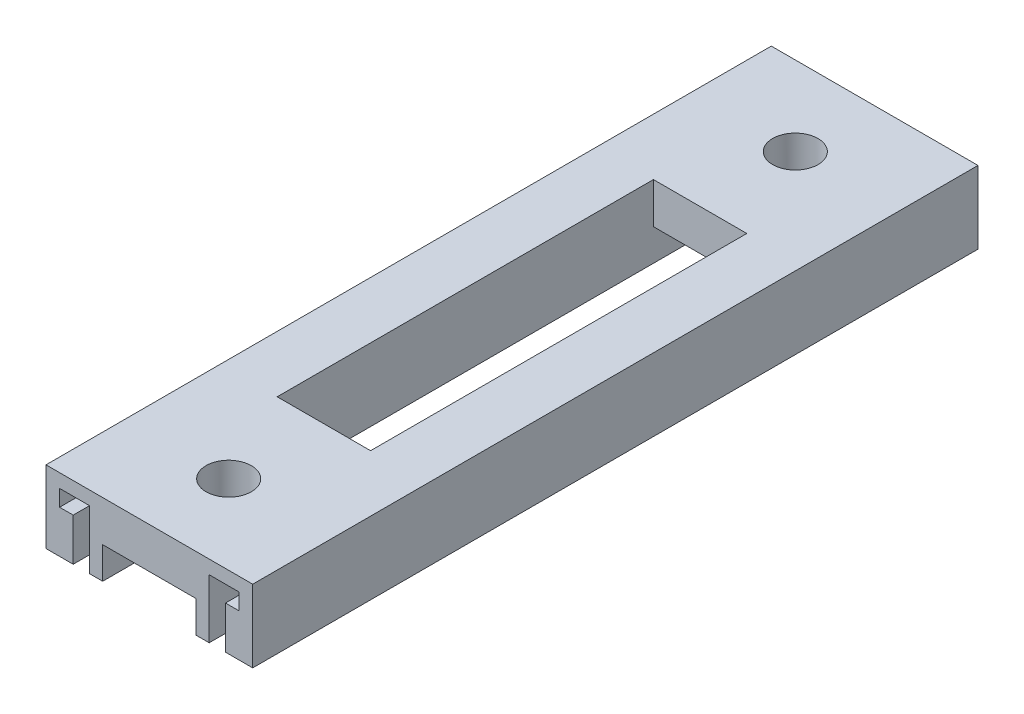
ISO-10303-21;
HEADER;
FILE_DESCRIPTION(('STEP AP214'),'2;1');
FILE_NAME('part.step','',(''),(''),'','','');
FILE_SCHEMA(('AUTOMOTIVE_DESIGN { 1 0 10303 214 1 1 1 1 }'));
ENDSEC;
DATA;
#1=APPLICATION_CONTEXT('core data for automotive mechanical design processes');
#2=APPLICATION_PROTOCOL_DEFINITION('international standard','automotive_design',2000,#1);
#3=PRODUCT_CONTEXT('',#1,'mechanical');
#4=PRODUCT('Part','Part','',(#3));
#5=PRODUCT_RELATED_PRODUCT_CATEGORY('part','',(#4));
#6=PRODUCT_DEFINITION_FORMATION('','',#4);
#7=PRODUCT_DEFINITION_CONTEXT('part definition',#1,'design');
#8=PRODUCT_DEFINITION('design','',#6,#7);
#9=PRODUCT_DEFINITION_SHAPE('','',#8);
#10=(LENGTH_UNIT() NAMED_UNIT(*) SI_UNIT(.MILLI.,.METRE.));
#11=(NAMED_UNIT(*) PLANE_ANGLE_UNIT() SI_UNIT($,.RADIAN.));
#12=(NAMED_UNIT(*) SI_UNIT($,.STERADIAN.) SOLID_ANGLE_UNIT());
#13=UNCERTAINTY_MEASURE_WITH_UNIT(LENGTH_MEASURE(1.E-05),#10,'distance_accuracy_value','');
#14=(GEOMETRIC_REPRESENTATION_CONTEXT(3) GLOBAL_UNCERTAINTY_ASSIGNED_CONTEXT((#13)) GLOBAL_UNIT_ASSIGNED_CONTEXT((#10,
#11,#12)) REPRESENTATION_CONTEXT('',''));
#15=CARTESIAN_POINT('',(0.,0.,0.));
#16=DIRECTION('',(0.,0.,1.));
#17=DIRECTION('',(1.,0.,0.));
#18=AXIS2_PLACEMENT_3D('',#15,#16,#17);
#19=CARTESIAN_POINT('',(0.,7.,0.));
#20=DIRECTION('',(0.,1.,0.));
#21=DIRECTION('',(0.,0.,1.));
#22=AXIS2_PLACEMENT_3D('',#19,#20,#21);
#23=PLANE('',#22);
#24=CARTESIAN_POINT('',(16.8,7.,17.5));
#25=DIRECTION('',(0.,1.,0.));
#26=DIRECTION('',(0.,0.,1.));
#27=AXIS2_PLACEMENT_3D('',#24,#25,#26);
#28=CIRCLE('',#27,5.);
#29=CARTESIAN_POINT('',(16.8,7.,22.5));
#30=VERTEX_POINT('',#29);
#31=EDGE_CURVE('E244',#30,#30,#28,.T.);
#32=ORIENTED_EDGE('',*,*,#31,.T.);
#33=EDGE_LOOP('',(#32));
#34=FACE_BOUND('',#33,.T.);
#35=DIRECTION('',(0.,0.,-1.));
#36=VECTOR('',#35,1.);
#37=CARTESIAN_POINT('',(27.1,7.,160.));
#38=LINE('',#37,#36);
#39=CARTESIAN_POINT('',(27.1,7.,38.5));
#40=VERTEX_POINT('',#39);
#41=CARTESIAN_POINT('',(27.1,7.,0.));
#42=VERTEX_POINT('',#41);
#43=EDGE_CURVE('E356',#40,#42,#38,.T.);
#44=ORIENTED_EDGE('',*,*,#43,.F.);
#45=DIRECTION('',(1.,0.,0.));
#46=VECTOR('',#45,1.);
#47=CARTESIAN_POINT('',(6.5,7.00000000000001,38.5));
#48=LINE('',#47,#46);
#49=CARTESIAN_POINT('',(6.49999999999999,7.00000000000001,38.5));
#50=VERTEX_POINT('',#49);
#51=EDGE_CURVE('E231',#50,#40,#48,.T.);
#52=ORIENTED_EDGE('',*,*,#51,.F.);
#53=DIRECTION('',(0.,0.,1.));
#54=VECTOR('',#53,1.);
#55=CARTESIAN_POINT('',(6.5,7.,160.));
#56=LINE('',#55,#54);
#57=CARTESIAN_POINT('',(6.5,7.,0.));
#58=VERTEX_POINT('',#57);
#59=EDGE_CURVE('E348',#58,#50,#56,.T.);
#60=ORIENTED_EDGE('',*,*,#59,.F.);
#61=DIRECTION('',(-1.,0.,0.));
#62=VECTOR('',#61,1.);
#63=CARTESIAN_POINT('',(6.5,7.,0.));
#64=LINE('',#63,#62);
#65=EDGE_CURVE('E359',#42,#58,#64,.T.);
#66=ORIENTED_EDGE('',*,*,#65,.F.);
#67=EDGE_LOOP('',(#44,#52,#60,#66));
#68=FACE_BOUND('',#67,.T.);
#69=ADVANCED_FACE('F38',(#34,#68),#23,.F.);
#70=CARTESIAN_POINT('',(-6.,0.,160.));
#71=DIRECTION('',(0.,1.,0.));
#72=DIRECTION('',(0.,0.,1.));
#73=AXIS2_PLACEMENT_3D('',#70,#71,#72);
#74=PLANE('',#73);
#75=DIRECTION('',(1.,0.,0.));
#76=VECTOR('',#75,1.);
#77=CARTESIAN_POINT('',(-6.,0.,0.));
#78=LINE('',#77,#76);
#79=CARTESIAN_POINT('',(-6.,0.,0.));
#80=VERTEX_POINT('',#79);
#81=CARTESIAN_POINT('',(0.,0.,0.));
#82=VERTEX_POINT('',#81);
#83=EDGE_CURVE('E363',#80,#82,#78,.T.);
#84=ORIENTED_EDGE('',*,*,#83,.T.);
#85=DIRECTION('',(0.,0.,-1.));
#86=VECTOR('',#85,1.);
#87=CARTESIAN_POINT('',(0.,0.,160.));
#88=LINE('',#87,#86);
#89=CARTESIAN_POINT('',(0.,0.,160.));
#90=VERTEX_POINT('',#89);
#91=EDGE_CURVE('E11',#90,#82,#88,.T.);
#92=ORIENTED_EDGE('',*,*,#91,.F.);
#93=DIRECTION('',(1.,0.,0.));
#94=VECTOR('',#93,1.);
#95=CARTESIAN_POINT('',(-6.,0.,160.));
#96=LINE('',#95,#94);
#97=CARTESIAN_POINT('',(-6.,0.,160.));
#98=VERTEX_POINT('',#97);
#99=EDGE_CURVE('E364',#98,#90,#96,.T.);
#100=ORIENTED_EDGE('',*,*,#99,.F.);
#101=DIRECTION('',(0.,0.,-1.));
#102=VECTOR('',#101,1.);
#103=CARTESIAN_POINT('',(-6.,0.,160.));
#104=LINE('',#103,#102);
#105=EDGE_CURVE('E397',#98,#80,#104,.T.);
#106=ORIENTED_EDGE('',*,*,#105,.T.);
#107=EDGE_LOOP('',(#84,#92,#100,#106));
#108=FACE_BOUND('',#107,.T.);
#109=ADVANCED_FACE('F40',(#108),#74,.F.);
#110=CARTESIAN_POINT('',(0.,0.,160.));
#111=DIRECTION('',(-1.,0.,0.));
#112=DIRECTION('',(0.,0.,1.));
#113=AXIS2_PLACEMENT_3D('',#110,#111,#112);
#114=PLANE('',#113);
#115=DIRECTION('',(0.,1.,0.));
#116=VECTOR('',#115,1.);
#117=CARTESIAN_POINT('',(0.,0.,0.));
#118=LINE('',#117,#116);
#119=CARTESIAN_POINT('',(0.,9.4,0.));
#120=VERTEX_POINT('',#119);
#121=EDGE_CURVE('E401',#82,#120,#118,.T.);
#122=ORIENTED_EDGE('',*,*,#121,.T.);
#123=DIRECTION('',(0.,0.,-1.));
#124=VECTOR('',#123,1.);
#125=CARTESIAN_POINT('',(0.,9.4,160.));
#126=LINE('',#125,#124);
#127=CARTESIAN_POINT('',(0.,9.4,160.));
#128=VERTEX_POINT('',#127);
#129=EDGE_CURVE('E47',#128,#120,#126,.T.);
#130=ORIENTED_EDGE('',*,*,#129,.F.);
#131=DIRECTION('',(0.,1.,0.));
#132=VECTOR('',#131,1.);
#133=CARTESIAN_POINT('',(0.,0.,160.));
#134=LINE('',#133,#132);
#135=EDGE_CURVE('E368',#90,#128,#134,.T.);
#136=ORIENTED_EDGE('',*,*,#135,.F.);
#137=ORIENTED_EDGE('',*,*,#91,.T.);
#138=EDGE_LOOP('',(#122,#130,#136,#137));
#139=FACE_BOUND('',#138,.T.);
#140=ADVANCED_FACE('F483',(#139),#114,.F.);
#141=CARTESIAN_POINT('',(0.,9.4,160.));
#142=DIRECTION('',(0.,-1.,0.));
#143=DIRECTION('',(0.,0.,-1.));
#144=AXIS2_PLACEMENT_3D('',#141,#142,#143);
#145=PLANE('',#144);
#146=DIRECTION('',(-1.,0.,0.));
#147=VECTOR('',#146,1.);
#148=CARTESIAN_POINT('',(0.,9.4,0.));
#149=LINE('',#148,#147);
#150=CARTESIAN_POINT('',(-3.,9.4,0.));
#151=VERTEX_POINT('',#150);
#152=EDGE_CURVE('E404',#120,#151,#149,.T.);
#153=ORIENTED_EDGE('',*,*,#152,.T.);
#154=DIRECTION('',(0.,0.,-1.));
#155=VECTOR('',#154,1.);
#156=CARTESIAN_POINT('',(-3.,9.4,160.));
#157=LINE('',#156,#155);
#158=CARTESIAN_POINT('',(-3.,9.4,160.));
#159=VERTEX_POINT('',#158);
#160=EDGE_CURVE('E451',#159,#151,#157,.T.);
#161=ORIENTED_EDGE('',*,*,#160,.F.);
#162=DIRECTION('',(-1.,0.,0.));
#163=VECTOR('',#162,1.);
#164=CARTESIAN_POINT('',(0.,9.4,160.));
#165=LINE('',#164,#163);
#166=EDGE_CURVE('E372',#128,#159,#165,.T.);
#167=ORIENTED_EDGE('',*,*,#166,.F.);
#168=ORIENTED_EDGE('',*,*,#129,.T.);
#169=EDGE_LOOP('',(#153,#161,#167,#168));
#170=FACE_BOUND('',#169,.T.);
#171=ADVANCED_FACE('F460',(#170),#145,.F.);
#172=CARTESIAN_POINT('',(-3.,9.4,160.));
#173=DIRECTION('',(-1.,0.,0.));
#174=DIRECTION('',(0.,0.,1.));
#175=AXIS2_PLACEMENT_3D('',#172,#173,#174);
#176=PLANE('',#175);
#177=DIRECTION('',(0.,1.,0.));
#178=VECTOR('',#177,1.);
#179=CARTESIAN_POINT('',(-3.,9.4,0.));
#180=LINE('',#179,#178);
#181=CARTESIAN_POINT('',(-3.,13.,0.));
#182=VERTEX_POINT('',#181);
#183=EDGE_CURVE('E407',#151,#182,#180,.T.);
#184=ORIENTED_EDGE('',*,*,#183,.T.);
#185=DIRECTION('',(0.,0.,-1.));
#186=VECTOR('',#185,1.);
#187=CARTESIAN_POINT('',(-3.,13.,160.));
#188=LINE('',#187,#186);
#189=CARTESIAN_POINT('',(-3.,13.,160.));
#190=VERTEX_POINT('',#189);
#191=EDGE_CURVE('E447',#190,#182,#188,.T.);
#192=ORIENTED_EDGE('',*,*,#191,.F.);
#193=DIRECTION('',(0.,1.,0.));
#194=VECTOR('',#193,1.);
#195=CARTESIAN_POINT('',(-3.,9.4,160.));
#196=LINE('',#195,#194);
#197=EDGE_CURVE('E375',#159,#190,#196,.T.);
#198=ORIENTED_EDGE('',*,*,#197,.F.);
#199=ORIENTED_EDGE('',*,*,#160,.T.);
#200=EDGE_LOOP('',(#184,#192,#198,#199));
#201=FACE_BOUND('',#200,.T.);
#202=ADVANCED_FACE('F471',(#201),#176,.F.);
#203=CARTESIAN_POINT('',(-3.,13.,160.));
#204=DIRECTION('',(0.,1.,0.));
#205=DIRECTION('',(0.,0.,1.));
#206=AXIS2_PLACEMENT_3D('',#203,#204,#205);
#207=PLANE('',#206);
#208=DIRECTION('',(1.,0.,0.));
#209=VECTOR('',#208,1.);
#210=CARTESIAN_POINT('',(-3.,13.,0.));
#211=LINE('',#210,#209);
#212=CARTESIAN_POINT('',(3.6,13.,0.));
#213=VERTEX_POINT('',#212);
#214=EDGE_CURVE('E410',#182,#213,#211,.T.);
#215=ORIENTED_EDGE('',*,*,#214,.T.);
#216=DIRECTION('',(0.,0.,-1.));
#217=VECTOR('',#216,1.);
#218=CARTESIAN_POINT('',(3.6,13.,160.));
#219=LINE('',#218,#217);
#220=CARTESIAN_POINT('',(3.6,13.,160.));
#221=VERTEX_POINT('',#220);
#222=EDGE_CURVE('E443',#221,#213,#219,.T.);
#223=ORIENTED_EDGE('',*,*,#222,.F.);
#224=DIRECTION('',(1.,0.,0.));
#225=VECTOR('',#224,1.);
#226=CARTESIAN_POINT('',(-3.,13.,160.));
#227=LINE('',#226,#225);
#228=EDGE_CURVE('E378',#190,#221,#227,.T.);
#229=ORIENTED_EDGE('',*,*,#228,.F.);
#230=ORIENTED_EDGE('',*,*,#191,.T.);
#231=EDGE_LOOP('',(#215,#223,#229,#230));
#232=FACE_BOUND('',#231,.T.);
#233=ADVANCED_FACE('F475',(#232),#207,.F.);
#234=CARTESIAN_POINT('',(3.6,13.,160.));
#235=DIRECTION('',(1.,0.,0.));
#236=DIRECTION('',(0.,0.,-1.));
#237=AXIS2_PLACEMENT_3D('',#234,#235,#236);
#238=PLANE('',#237);
#239=DIRECTION('',(0.,-1.,0.));
#240=VECTOR('',#239,1.);
#241=CARTESIAN_POINT('',(3.6,13.,0.));
#242=LINE('',#241,#240);
#243=CARTESIAN_POINT('',(3.6,0.,0.));
#244=VERTEX_POINT('',#243);
#245=EDGE_CURVE('E413',#213,#244,#242,.T.);
#246=ORIENTED_EDGE('',*,*,#245,.T.);
#247=DIRECTION('',(0.,0.,-1.));
#248=VECTOR('',#247,1.);
#249=CARTESIAN_POINT('',(3.6,0.,160.));
#250=LINE('',#249,#248);
#251=CARTESIAN_POINT('',(3.6,0.,160.));
#252=VERTEX_POINT('',#251);
#253=EDGE_CURVE('E439',#252,#244,#250,.T.);
#254=ORIENTED_EDGE('',*,*,#253,.F.);
#255=DIRECTION('',(0.,-1.,0.));
#256=VECTOR('',#255,1.);
#257=CARTESIAN_POINT('',(3.6,13.,160.));
#258=LINE('',#257,#256);
#259=EDGE_CURVE('E381',#221,#252,#258,.T.);
#260=ORIENTED_EDGE('',*,*,#259,.F.);
#261=ORIENTED_EDGE('',*,*,#222,.T.);
#262=EDGE_LOOP('',(#246,#254,#260,#261));
#263=FACE_BOUND('',#262,.T.);
#264=ADVANCED_FACE('F548',(#263),#238,.F.);
#265=CARTESIAN_POINT('',(3.6,0.,160.));
#266=DIRECTION('',(0.,1.,0.));
#267=DIRECTION('',(0.,0.,1.));
#268=AXIS2_PLACEMENT_3D('',#265,#266,#267);
#269=PLANE('',#268);
#270=DIRECTION('',(1.,0.,0.));
#271=VECTOR('',#270,1.);
#272=CARTESIAN_POINT('',(3.6,0.,0.));
#273=LINE('',#272,#271);
#274=CARTESIAN_POINT('',(6.5,0.,0.));
#275=VERTEX_POINT('',#274);
#276=EDGE_CURVE('E416',#244,#275,#273,.T.);
#277=ORIENTED_EDGE('',*,*,#276,.T.);
#278=DIRECTION('',(0.,0.,-1.));
#279=VECTOR('',#278,1.);
#280=CARTESIAN_POINT('',(6.5,0.,160.));
#281=LINE('',#280,#279);
#282=CARTESIAN_POINT('',(6.5,0.,160.));
#283=VERTEX_POINT('',#282);
#284=EDGE_CURVE('E435',#283,#275,#281,.T.);
#285=ORIENTED_EDGE('',*,*,#284,.F.);
#286=DIRECTION('',(1.,0.,0.));
#287=VECTOR('',#286,1.);
#288=CARTESIAN_POINT('',(3.6,0.,160.));
#289=LINE('',#288,#287);
#290=EDGE_CURVE('E384',#252,#283,#289,.T.);
#291=ORIENTED_EDGE('',*,*,#290,.F.);
#292=ORIENTED_EDGE('',*,*,#253,.T.);
#293=EDGE_LOOP('',(#277,#285,#291,#292));
#294=FACE_BOUND('',#293,.T.);
#295=ADVANCED_FACE('F546',(#294),#269,.F.);
#296=CARTESIAN_POINT('',(6.5,0.,160.));
#297=DIRECTION('',(-1.,0.,0.));
#298=DIRECTION('',(0.,0.,1.));
#299=AXIS2_PLACEMENT_3D('',#296,#297,#298);
#300=PLANE('',#299);
#301=DIRECTION('',(0.,1.,0.));
#302=VECTOR('',#301,1.);
#303=CARTESIAN_POINT('',(6.5,0.,0.));
#304=LINE('',#303,#302);
#305=EDGE_CURVE('E419',#275,#58,#304,.T.);
#306=ORIENTED_EDGE('',*,*,#305,.T.);
#307=ORIENTED_EDGE('',*,*,#59,.T.);
#308=DIRECTION('',(0.,1.,0.));
#309=VECTOR('',#308,1.);
#310=CARTESIAN_POINT('',(6.49999999999999,-78.5181852005759,38.5));
#311=LINE('',#310,#309);
#312=CARTESIAN_POINT('',(6.49999999999999,16.,38.5));
#313=VERTEX_POINT('',#312);
#314=EDGE_CURVE('E228',#50,#313,#311,.T.);
#315=ORIENTED_EDGE('',*,*,#314,.T.);
#316=DIRECTION('',(0.,0.,1.));
#317=VECTOR('',#316,1.);
#318=CARTESIAN_POINT('',(6.5,16.,160.));
#319=LINE('',#318,#317);
#320=CARTESIAN_POINT('',(6.5,16.,121.5));
#321=VERTEX_POINT('',#320);
#322=EDGE_CURVE('E54',#313,#321,#319,.T.);
#323=ORIENTED_EDGE('',*,*,#322,.T.);
#324=DIRECTION('',(0.,1.,0.));
#325=VECTOR('',#324,1.);
#326=CARTESIAN_POINT('',(6.5,-78.5181852005759,121.5));
#327=LINE('',#326,#325);
#328=CARTESIAN_POINT('',(6.5,7.00000000000001,121.5));
#329=VERTEX_POINT('',#328);
#330=EDGE_CURVE('E210',#329,#321,#327,.T.);
#331=ORIENTED_EDGE('',*,*,#330,.F.);
#332=CARTESIAN_POINT('',(6.5,7.,160.));
#333=VERTEX_POINT('',#332);
#334=EDGE_CURVE('E347',#329,#333,#56,.T.);
#335=ORIENTED_EDGE('',*,*,#334,.T.);
#336=DIRECTION('',(0.,1.,0.));
#337=VECTOR('',#336,1.);
#338=CARTESIAN_POINT('',(6.5,0.,160.));
#339=LINE('',#338,#337);
#340=EDGE_CURVE('E387',#283,#333,#339,.T.);
#341=ORIENTED_EDGE('',*,*,#340,.F.);
#342=ORIENTED_EDGE('',*,*,#284,.T.);
#343=EDGE_LOOP('',(#306,#307,#315,#323,#331,#335,#341,#342));
#344=FACE_BOUND('',#343,.T.);
#345=ADVANCED_FACE('F541',(#344),#300,.F.);
#346=CARTESIAN_POINT('',(6.5,16.,160.));
#347=DIRECTION('',(0.,-1.,0.));
#348=DIRECTION('',(0.,0.,-1.));
#349=AXIS2_PLACEMENT_3D('',#346,#347,#348);
#350=PLANE('',#349);
#351=DIRECTION('',(1.,0.,0.));
#352=VECTOR('',#351,1.);
#353=CARTESIAN_POINT('',(6.5,16.,121.5));
#354=LINE('',#353,#352);
#355=CARTESIAN_POINT('',(27.1,16.,121.5));
#356=VERTEX_POINT('',#355);
#357=EDGE_CURVE('E213',#321,#356,#354,.T.);
#358=ORIENTED_EDGE('',*,*,#357,.F.);
#359=ORIENTED_EDGE('',*,*,#322,.F.);
#360=DIRECTION('',(-1.,0.,0.));
#361=VECTOR('',#360,1.);
#362=CARTESIAN_POINT('',(6.5,16.,38.5));
#363=LINE('',#362,#361);
#364=CARTESIAN_POINT('',(27.1,16.,38.5));
#365=VERTEX_POINT('',#364);
#366=EDGE_CURVE('E221',#365,#313,#363,.T.);
#367=ORIENTED_EDGE('',*,*,#366,.F.);
#368=DIRECTION('',(0.,0.,-1.));
#369=VECTOR('',#368,1.);
#370=CARTESIAN_POINT('',(27.1,16.,160.));
#371=LINE('',#370,#369);
#372=EDGE_CURVE('E204',#356,#365,#371,.T.);
#373=ORIENTED_EDGE('',*,*,#372,.F.);
#374=EDGE_LOOP('',(#358,#359,#367,#373));
#375=FACE_BOUND('',#374,.T.);
#376=CARTESIAN_POINT('',(16.8,16.,17.5));
#377=DIRECTION('',(0.,-1.,0.));
#378=DIRECTION('',(0.,0.,-1.));
#379=AXIS2_PLACEMENT_3D('',#376,#377,#378);
#380=CIRCLE('',#379,5.);
#381=CARTESIAN_POINT('',(16.8,16.,12.5));
#382=VERTEX_POINT('',#381);
#383=EDGE_CURVE('E240',#382,#382,#380,.T.);
#384=ORIENTED_EDGE('',*,*,#383,.T.);
#385=EDGE_LOOP('',(#384));
#386=FACE_BOUND('',#385,.T.);
#387=CARTESIAN_POINT('',(16.8,16.,142.5));
#388=DIRECTION('',(0.,-1.,0.));
#389=DIRECTION('',(0.,0.,-1.));
#390=AXIS2_PLACEMENT_3D('',#387,#388,#389);
#391=CIRCLE('',#390,5.);
#392=CARTESIAN_POINT('',(16.8,16.,137.5));
#393=VERTEX_POINT('',#392);
#394=EDGE_CURVE('E239',#393,#393,#391,.T.);
#395=ORIENTED_EDGE('',*,*,#394,.T.);
#396=EDGE_LOOP('',(#395));
#397=FACE_BOUND('',#396,.T.);
#398=DIRECTION('',(-1.,0.,0.));
#399=VECTOR('',#398,1.);
#400=CARTESIAN_POINT('',(6.5,16.,0.));
#401=LINE('',#400,#399);
#402=CARTESIAN_POINT('',(39.6,16.,0.));
#403=VERTEX_POINT('',#402);
#404=CARTESIAN_POINT('',(-6.,16.,0.));
#405=VERTEX_POINT('',#404);
#406=EDGE_CURVE('E423',#403,#405,#401,.T.);
#407=ORIENTED_EDGE('',*,*,#406,.T.);
#408=DIRECTION('',(0.,0.,-1.));
#409=VECTOR('',#408,1.);
#410=CARTESIAN_POINT('',(-6.,16.,160.));
#411=LINE('',#410,#409);
#412=CARTESIAN_POINT('',(-6.,16.,160.));
#413=VERTEX_POINT('',#412);
#414=EDGE_CURVE('E431',#413,#405,#411,.T.);
#415=ORIENTED_EDGE('',*,*,#414,.F.);
#416=DIRECTION('',(-1.,0.,0.));
#417=VECTOR('',#416,1.);
#418=CARTESIAN_POINT('',(6.5,16.,160.));
#419=LINE('',#418,#417);
#420=CARTESIAN_POINT('',(39.6,16.,160.));
#421=VERTEX_POINT('',#420);
#422=EDGE_CURVE('E391',#421,#413,#419,.T.);
#423=ORIENTED_EDGE('',*,*,#422,.F.);
#424=DIRECTION('',(0.,0.,-1.));
#425=VECTOR('',#424,1.);
#426=CARTESIAN_POINT('',(39.6,16.,160.));
#427=LINE('',#426,#425);
#428=EDGE_CURVE('E343',#421,#403,#427,.T.);
#429=ORIENTED_EDGE('',*,*,#428,.T.);
#430=EDGE_LOOP('',(#407,#415,#423,#429));
#431=FACE_BOUND('',#430,.T.);
#432=ADVANCED_FACE('F218',(#375,#386,#397,#431),#350,.F.);
#433=CARTESIAN_POINT('',(-6.,16.,160.));
#434=DIRECTION('',(1.,0.,0.));
#435=DIRECTION('',(0.,0.,-1.));
#436=AXIS2_PLACEMENT_3D('',#433,#434,#435);
#437=PLANE('',#436);
#438=DIRECTION('',(0.,-1.,0.));
#439=VECTOR('',#438,1.);
#440=CARTESIAN_POINT('',(-6.,16.,0.));
#441=LINE('',#440,#439);
#442=EDGE_CURVE('E369',#405,#80,#441,.T.);
#443=ORIENTED_EDGE('',*,*,#442,.T.);
#444=ORIENTED_EDGE('',*,*,#105,.F.);
#445=DIRECTION('',(0.,-1.,0.));
#446=VECTOR('',#445,1.);
#447=CARTESIAN_POINT('',(-6.,16.,160.));
#448=LINE('',#447,#446);
#449=EDGE_CURVE('E394',#413,#98,#448,.T.);
#450=ORIENTED_EDGE('',*,*,#449,.F.);
#451=ORIENTED_EDGE('',*,*,#414,.T.);
#452=EDGE_LOOP('',(#443,#444,#450,#451));
#453=FACE_BOUND('',#452,.T.);
#454=ADVANCED_FACE('F489',(#453),#437,.F.);
#455=CARTESIAN_POINT('',(0.,0.,160.));
#456=DIRECTION('',(0.,0.,1.));
#457=DIRECTION('',(1.,0.,0.));
#458=AXIS2_PLACEMENT_3D('',#455,#456,#457);
#459=PLANE('',#458);
#460=ORIENTED_EDGE('',*,*,#99,.T.);
#461=ORIENTED_EDGE('',*,*,#135,.T.);
#462=ORIENTED_EDGE('',*,*,#166,.T.);
#463=ORIENTED_EDGE('',*,*,#197,.T.);
#464=ORIENTED_EDGE('',*,*,#228,.T.);
#465=ORIENTED_EDGE('',*,*,#259,.T.);
#466=ORIENTED_EDGE('',*,*,#290,.T.);
#467=ORIENTED_EDGE('',*,*,#340,.T.);
#468=DIRECTION('',(1.,0.,0.));
#469=VECTOR('',#468,1.);
#470=CARTESIAN_POINT('',(6.5,7.,160.));
#471=LINE('',#470,#469);
#472=CARTESIAN_POINT('',(27.1,7.,160.));
#473=VERTEX_POINT('',#472);
#474=EDGE_CURVE('E352',#333,#473,#471,.T.);
#475=ORIENTED_EDGE('',*,*,#474,.T.);
#476=DIRECTION('',(0.,-1.,0.));
#477=VECTOR('',#476,1.);
#478=CARTESIAN_POINT('',(27.1,0.,160.));
#479=LINE('',#478,#477);
#480=CARTESIAN_POINT('',(27.1,0.,160.));
#481=VERTEX_POINT('',#480);
#482=EDGE_CURVE('E260',#473,#481,#479,.T.);
#483=ORIENTED_EDGE('',*,*,#482,.T.);
#484=DIRECTION('',(1.,0.,0.));
#485=VECTOR('',#484,1.);
#486=CARTESIAN_POINT('',(30.,0.,160.));
#487=LINE('',#486,#485);
#488=CARTESIAN_POINT('',(30.,0.,160.));
#489=VERTEX_POINT('',#488);
#490=EDGE_CURVE('E264',#481,#489,#487,.T.);
#491=ORIENTED_EDGE('',*,*,#490,.T.);
#492=DIRECTION('',(0.,1.,0.));
#493=VECTOR('',#492,1.);
#494=CARTESIAN_POINT('',(30.,13.,160.));
#495=LINE('',#494,#493);
#496=CARTESIAN_POINT('',(30.,13.,160.));
#497=VERTEX_POINT('',#496);
#498=EDGE_CURVE('E267',#489,#497,#495,.T.);
#499=ORIENTED_EDGE('',*,*,#498,.T.);
#500=DIRECTION('',(1.,0.,0.));
#501=VECTOR('',#500,1.);
#502=CARTESIAN_POINT('',(36.6,13.,160.));
#503=LINE('',#502,#501);
#504=CARTESIAN_POINT('',(36.6,13.,160.));
#505=VERTEX_POINT('',#504);
#506=EDGE_CURVE('E270',#497,#505,#503,.T.);
#507=ORIENTED_EDGE('',*,*,#506,.T.);
#508=DIRECTION('',(0.,-1.,0.));
#509=VECTOR('',#508,1.);
#510=CARTESIAN_POINT('',(36.6,9.4,160.));
#511=LINE('',#510,#509);
#512=CARTESIAN_POINT('',(36.6,9.4,160.));
#513=VERTEX_POINT('',#512);
#514=EDGE_CURVE('E273',#505,#513,#511,.T.);
#515=ORIENTED_EDGE('',*,*,#514,.T.);
#516=DIRECTION('',(-1.,0.,0.));
#517=VECTOR('',#516,1.);
#518=CARTESIAN_POINT('',(33.6,9.4,160.));
#519=LINE('',#518,#517);
#520=CARTESIAN_POINT('',(33.6,9.4,160.));
#521=VERTEX_POINT('',#520);
#522=EDGE_CURVE('E276',#513,#521,#519,.T.);
#523=ORIENTED_EDGE('',*,*,#522,.T.);
#524=DIRECTION('',(0.,-1.,0.));
#525=VECTOR('',#524,1.);
#526=CARTESIAN_POINT('',(33.6,0.,160.));
#527=LINE('',#526,#525);
#528=CARTESIAN_POINT('',(33.6,0.,160.));
#529=VERTEX_POINT('',#528);
#530=EDGE_CURVE('E279',#521,#529,#527,.T.);
#531=ORIENTED_EDGE('',*,*,#530,.T.);
#532=DIRECTION('',(1.,0.,0.));
#533=VECTOR('',#532,1.);
#534=CARTESIAN_POINT('',(39.6,0.,160.));
#535=LINE('',#534,#533);
#536=CARTESIAN_POINT('',(39.6,0.,160.));
#537=VERTEX_POINT('',#536);
#538=EDGE_CURVE('E282',#529,#537,#535,.T.);
#539=ORIENTED_EDGE('',*,*,#538,.T.);
#540=DIRECTION('',(0.,1.,0.));
#541=VECTOR('',#540,1.);
#542=CARTESIAN_POINT('',(39.6,16.,160.));
#543=LINE('',#542,#541);
#544=EDGE_CURVE('E256',#537,#421,#543,.T.);
#545=ORIENTED_EDGE('',*,*,#544,.T.);
#546=ORIENTED_EDGE('',*,*,#422,.T.);
#547=ORIENTED_EDGE('',*,*,#449,.T.);
#548=EDGE_LOOP('',(#460,#461,#462,#463,#464,#465,#466,#467,#475,#483,#491,#499,#507,#515,#523,
#531,#539,#545,#546,#547));
#549=FACE_BOUND('',#548,.T.);
#550=ADVANCED_FACE('F479',(#549),#459,.T.);
#551=CARTESIAN_POINT('',(0.,0.,0.));
#552=DIRECTION('',(0.,0.,1.));
#553=DIRECTION('',(1.,0.,0.));
#554=AXIS2_PLACEMENT_3D('',#551,#552,#553);
#555=PLANE('',#554);
#556=ORIENTED_EDGE('',*,*,#83,.F.);
#557=ORIENTED_EDGE('',*,*,#442,.F.);
#558=ORIENTED_EDGE('',*,*,#406,.F.);
#559=DIRECTION('',(0.,1.,0.));
#560=VECTOR('',#559,1.);
#561=CARTESIAN_POINT('',(39.6,16.,0.));
#562=LINE('',#561,#560);
#563=CARTESIAN_POINT('',(39.6,0.,0.));
#564=VERTEX_POINT('',#563);
#565=EDGE_CURVE('E249',#564,#403,#562,.T.);
#566=ORIENTED_EDGE('',*,*,#565,.F.);
#567=DIRECTION('',(1.,0.,0.));
#568=VECTOR('',#567,1.);
#569=CARTESIAN_POINT('',(39.6,0.,0.));
#570=LINE('',#569,#568);
#571=CARTESIAN_POINT('',(33.6,0.,0.));
#572=VERTEX_POINT('',#571);
#573=EDGE_CURVE('E261',#572,#564,#570,.T.);
#574=ORIENTED_EDGE('',*,*,#573,.F.);
#575=DIRECTION('',(0.,-1.,0.));
#576=VECTOR('',#575,1.);
#577=CARTESIAN_POINT('',(33.6,0.,0.));
#578=LINE('',#577,#576);
#579=CARTESIAN_POINT('',(33.6,9.4,0.));
#580=VERTEX_POINT('',#579);
#581=EDGE_CURVE('E307',#580,#572,#578,.T.);
#582=ORIENTED_EDGE('',*,*,#581,.F.);
#583=DIRECTION('',(-1.,0.,0.));
#584=VECTOR('',#583,1.);
#585=CARTESIAN_POINT('',(33.6,9.4,0.));
#586=LINE('',#585,#584);
#587=CARTESIAN_POINT('',(36.6,9.4,0.));
#588=VERTEX_POINT('',#587);
#589=EDGE_CURVE('E304',#588,#580,#586,.T.);
#590=ORIENTED_EDGE('',*,*,#589,.F.);
#591=DIRECTION('',(0.,-1.,0.));
#592=VECTOR('',#591,1.);
#593=CARTESIAN_POINT('',(36.6,9.4,0.));
#594=LINE('',#593,#592);
#595=CARTESIAN_POINT('',(36.6,13.,0.));
#596=VERTEX_POINT('',#595);
#597=EDGE_CURVE('E301',#596,#588,#594,.T.);
#598=ORIENTED_EDGE('',*,*,#597,.F.);
#599=DIRECTION('',(1.,0.,0.));
#600=VECTOR('',#599,1.);
#601=CARTESIAN_POINT('',(36.6,13.,0.));
#602=LINE('',#601,#600);
#603=CARTESIAN_POINT('',(30.,13.,0.));
#604=VERTEX_POINT('',#603);
#605=EDGE_CURVE('E298',#604,#596,#602,.T.);
#606=ORIENTED_EDGE('',*,*,#605,.F.);
#607=DIRECTION('',(0.,1.,0.));
#608=VECTOR('',#607,1.);
#609=CARTESIAN_POINT('',(30.,13.,0.));
#610=LINE('',#609,#608);
#611=CARTESIAN_POINT('',(30.,0.,0.));
#612=VERTEX_POINT('',#611);
#613=EDGE_CURVE('E295',#612,#604,#610,.T.);
#614=ORIENTED_EDGE('',*,*,#613,.F.);
#615=DIRECTION('',(1.,0.,0.));
#616=VECTOR('',#615,1.);
#617=CARTESIAN_POINT('',(30.,0.,0.));
#618=LINE('',#617,#616);
#619=CARTESIAN_POINT('',(27.1,0.,0.));
#620=VERTEX_POINT('',#619);
#621=EDGE_CURVE('E292',#620,#612,#618,.T.);
#622=ORIENTED_EDGE('',*,*,#621,.F.);
#623=DIRECTION('',(0.,-1.,0.));
#624=VECTOR('',#623,1.);
#625=CARTESIAN_POINT('',(27.1,0.,0.));
#626=LINE('',#625,#624);
#627=EDGE_CURVE('E289',#42,#620,#626,.T.);
#628=ORIENTED_EDGE('',*,*,#627,.F.);
#629=ORIENTED_EDGE('',*,*,#65,.T.);
#630=ORIENTED_EDGE('',*,*,#305,.F.);
#631=ORIENTED_EDGE('',*,*,#276,.F.);
#632=ORIENTED_EDGE('',*,*,#245,.F.);
#633=ORIENTED_EDGE('',*,*,#214,.F.);
#634=ORIENTED_EDGE('',*,*,#183,.F.);
#635=ORIENTED_EDGE('',*,*,#152,.F.);
#636=ORIENTED_EDGE('',*,*,#121,.F.);
#637=EDGE_LOOP('',(#556,#557,#558,#566,#574,#582,#590,#598,#606,#614,#622,#628,#629,#630,#631,
#632,#633,#634,#635,#636));
#638=FACE_BOUND('',#637,.T.);
#639=ADVANCED_FACE('F466',(#638),#555,.F.);
#640=CARTESIAN_POINT('',(16.8,7.,142.5));
#641=DIRECTION('',(0.,1.,0.));
#642=DIRECTION('',(0.,0.,1.));
#643=AXIS2_PLACEMENT_3D('',#640,#641,#642);
#644=CIRCLE('',#643,5.);
#645=CARTESIAN_POINT('',(16.8,7.,147.5));
#646=VERTEX_POINT('',#645);
#647=EDGE_CURVE('E245',#646,#646,#644,.T.);
#648=ORIENTED_EDGE('',*,*,#647,.T.);
#649=EDGE_LOOP('',(#648));
#650=FACE_BOUND('',#649,.T.);
#651=ORIENTED_EDGE('',*,*,#334,.F.);
#652=DIRECTION('',(-1.,0.,0.));
#653=VECTOR('',#652,1.);
#654=CARTESIAN_POINT('',(6.5,7.00000000000001,121.5));
#655=LINE('',#654,#653);
#656=CARTESIAN_POINT('',(27.1,7.00000000000001,121.5));
#657=VERTEX_POINT('',#656);
#658=EDGE_CURVE('E236',#657,#329,#655,.T.);
#659=ORIENTED_EDGE('',*,*,#658,.F.);
#660=EDGE_CURVE('E206',#473,#657,#38,.T.);
#661=ORIENTED_EDGE('',*,*,#660,.F.);
#662=ORIENTED_EDGE('',*,*,#474,.F.);
#663=EDGE_LOOP('',(#651,#659,#661,#662));
#664=FACE_BOUND('',#663,.T.);
#665=ADVANCED_FACE('F560',(#650,#664),#23,.F.);
#666=CARTESIAN_POINT('',(27.1,0.,160.));
#667=DIRECTION('',(1.,0.,0.));
#668=DIRECTION('',(0.,0.,-1.));
#669=AXIS2_PLACEMENT_3D('',#666,#667,#668);
#670=PLANE('',#669);
#671=ORIENTED_EDGE('',*,*,#482,.F.);
#672=ORIENTED_EDGE('',*,*,#660,.T.);
#673=DIRECTION('',(0.,1.,0.));
#674=VECTOR('',#673,1.);
#675=CARTESIAN_POINT('',(27.1,-78.5181852005759,121.5));
#676=LINE('',#675,#674);
#677=EDGE_CURVE('E199',#657,#356,#676,.T.);
#678=ORIENTED_EDGE('',*,*,#677,.T.);
#679=ORIENTED_EDGE('',*,*,#372,.T.);
#680=DIRECTION('',(0.,1.,0.));
#681=VECTOR('',#680,1.);
#682=CARTESIAN_POINT('',(27.1,-78.5181852005759,38.5));
#683=LINE('',#682,#681);
#684=EDGE_CURVE('E62',#40,#365,#683,.T.);
#685=ORIENTED_EDGE('',*,*,#684,.F.);
#686=ORIENTED_EDGE('',*,*,#43,.T.);
#687=ORIENTED_EDGE('',*,*,#627,.T.);
#688=DIRECTION('',(0.,0.,-1.));
#689=VECTOR('',#688,1.);
#690=CARTESIAN_POINT('',(27.1,0.,160.));
#691=LINE('',#690,#689);
#692=EDGE_CURVE('E339',#481,#620,#691,.T.);
#693=ORIENTED_EDGE('',*,*,#692,.F.);
#694=EDGE_LOOP('',(#671,#672,#678,#679,#685,#686,#687,#693));
#695=FACE_BOUND('',#694,.T.);
#696=ADVANCED_FACE('F202',(#695),#670,.F.);
#697=CARTESIAN_POINT('',(39.6,16.,160.));
#698=DIRECTION('',(-1.,0.,0.));
#699=DIRECTION('',(0.,0.,1.));
#700=AXIS2_PLACEMENT_3D('',#697,#698,#699);
#701=PLANE('',#700);
#702=ORIENTED_EDGE('',*,*,#565,.T.);
#703=ORIENTED_EDGE('',*,*,#428,.F.);
#704=ORIENTED_EDGE('',*,*,#544,.F.);
#705=DIRECTION('',(0.,0.,-1.));
#706=VECTOR('',#705,1.);
#707=CARTESIAN_POINT('',(39.6,0.,160.));
#708=LINE('',#707,#706);
#709=EDGE_CURVE('E285',#537,#564,#708,.T.);
#710=ORIENTED_EDGE('',*,*,#709,.T.);
#711=EDGE_LOOP('',(#702,#703,#704,#710));
#712=FACE_BOUND('',#711,.T.);
#713=ADVANCED_FACE('F496',(#712),#701,.F.);
#714=CARTESIAN_POINT('',(30.,0.,160.));
#715=DIRECTION('',(0.,1.,0.));
#716=DIRECTION('',(0.,0.,1.));
#717=AXIS2_PLACEMENT_3D('',#714,#715,#716);
#718=PLANE('',#717);
#719=ORIENTED_EDGE('',*,*,#621,.T.);
#720=DIRECTION('',(0.,0.,-1.));
#721=VECTOR('',#720,1.);
#722=CARTESIAN_POINT('',(30.,0.,160.));
#723=LINE('',#722,#721);
#724=EDGE_CURVE('E335',#489,#612,#723,.T.);
#725=ORIENTED_EDGE('',*,*,#724,.F.);
#726=ORIENTED_EDGE('',*,*,#490,.F.);
#727=ORIENTED_EDGE('',*,*,#692,.T.);
#728=EDGE_LOOP('',(#719,#725,#726,#727));
#729=FACE_BOUND('',#728,.T.);
#730=ADVANCED_FACE('F531',(#729),#718,.F.);
#731=CARTESIAN_POINT('',(30.,13.,160.));
#732=DIRECTION('',(-1.,0.,0.));
#733=DIRECTION('',(0.,0.,1.));
#734=AXIS2_PLACEMENT_3D('',#731,#732,#733);
#735=PLANE('',#734);
#736=ORIENTED_EDGE('',*,*,#613,.T.);
#737=DIRECTION('',(0.,0.,-1.));
#738=VECTOR('',#737,1.);
#739=CARTESIAN_POINT('',(30.,13.,160.));
#740=LINE('',#739,#738);
#741=EDGE_CURVE('E331',#497,#604,#740,.T.);
#742=ORIENTED_EDGE('',*,*,#741,.F.);
#743=ORIENTED_EDGE('',*,*,#498,.F.);
#744=ORIENTED_EDGE('',*,*,#724,.T.);
#745=EDGE_LOOP('',(#736,#742,#743,#744));
#746=FACE_BOUND('',#745,.T.);
#747=ADVANCED_FACE('F526',(#746),#735,.F.);
#748=CARTESIAN_POINT('',(36.6,13.,160.));
#749=DIRECTION('',(0.,1.,0.));
#750=DIRECTION('',(0.,0.,1.));
#751=AXIS2_PLACEMENT_3D('',#748,#749,#750);
#752=PLANE('',#751);
#753=ORIENTED_EDGE('',*,*,#605,.T.);
#754=DIRECTION('',(0.,0.,-1.));
#755=VECTOR('',#754,1.);
#756=CARTESIAN_POINT('',(36.6,13.,160.));
#757=LINE('',#756,#755);
#758=EDGE_CURVE('E327',#505,#596,#757,.T.);
#759=ORIENTED_EDGE('',*,*,#758,.F.);
#760=ORIENTED_EDGE('',*,*,#506,.F.);
#761=ORIENTED_EDGE('',*,*,#741,.T.);
#762=EDGE_LOOP('',(#753,#759,#760,#761));
#763=FACE_BOUND('',#762,.T.);
#764=ADVANCED_FACE('F522',(#763),#752,.F.);
#765=CARTESIAN_POINT('',(36.6,9.4,160.));
#766=DIRECTION('',(1.,0.,0.));
#767=DIRECTION('',(0.,0.,-1.));
#768=AXIS2_PLACEMENT_3D('',#765,#766,#767);
#769=PLANE('',#768);
#770=ORIENTED_EDGE('',*,*,#597,.T.);
#771=DIRECTION('',(0.,0.,-1.));
#772=VECTOR('',#771,1.);
#773=CARTESIAN_POINT('',(36.6,9.4,160.));
#774=LINE('',#773,#772);
#775=EDGE_CURVE('E323',#513,#588,#774,.T.);
#776=ORIENTED_EDGE('',*,*,#775,.F.);
#777=ORIENTED_EDGE('',*,*,#514,.F.);
#778=ORIENTED_EDGE('',*,*,#758,.T.);
#779=EDGE_LOOP('',(#770,#776,#777,#778));
#780=FACE_BOUND('',#779,.T.);
#781=ADVANCED_FACE('F517',(#780),#769,.F.);
#782=CARTESIAN_POINT('',(33.6,9.4,160.));
#783=DIRECTION('',(0.,-1.,0.));
#784=DIRECTION('',(0.,0.,-1.));
#785=AXIS2_PLACEMENT_3D('',#782,#783,#784);
#786=PLANE('',#785);
#787=ORIENTED_EDGE('',*,*,#589,.T.);
#788=DIRECTION('',(0.,0.,-1.));
#789=VECTOR('',#788,1.);
#790=CARTESIAN_POINT('',(33.6,9.4,160.));
#791=LINE('',#790,#789);
#792=EDGE_CURVE('E319',#521,#580,#791,.T.);
#793=ORIENTED_EDGE('',*,*,#792,.F.);
#794=ORIENTED_EDGE('',*,*,#522,.F.);
#795=ORIENTED_EDGE('',*,*,#775,.T.);
#796=EDGE_LOOP('',(#787,#793,#794,#795));
#797=FACE_BOUND('',#796,.T.);
#798=ADVANCED_FACE('F511',(#797),#786,.F.);
#799=CARTESIAN_POINT('',(33.6,0.,160.));
#800=DIRECTION('',(1.,0.,0.));
#801=DIRECTION('',(0.,0.,-1.));
#802=AXIS2_PLACEMENT_3D('',#799,#800,#801);
#803=PLANE('',#802);
#804=ORIENTED_EDGE('',*,*,#581,.T.);
#805=DIRECTION('',(0.,0.,-1.));
#806=VECTOR('',#805,1.);
#807=CARTESIAN_POINT('',(33.6,0.,160.));
#808=LINE('',#807,#806);
#809=EDGE_CURVE('E315',#529,#572,#808,.T.);
#810=ORIENTED_EDGE('',*,*,#809,.F.);
#811=ORIENTED_EDGE('',*,*,#530,.F.);
#812=ORIENTED_EDGE('',*,*,#792,.T.);
#813=EDGE_LOOP('',(#804,#810,#811,#812));
#814=FACE_BOUND('',#813,.T.);
#815=ADVANCED_FACE('F507',(#814),#803,.F.);
#816=CARTESIAN_POINT('',(39.6,0.,160.));
#817=DIRECTION('',(0.,1.,0.));
#818=DIRECTION('',(0.,0.,1.));
#819=AXIS2_PLACEMENT_3D('',#816,#817,#818);
#820=PLANE('',#819);
#821=ORIENTED_EDGE('',*,*,#573,.T.);
#822=ORIENTED_EDGE('',*,*,#709,.F.);
#823=ORIENTED_EDGE('',*,*,#538,.F.);
#824=ORIENTED_EDGE('',*,*,#809,.T.);
#825=EDGE_LOOP('',(#821,#822,#823,#824));
#826=FACE_BOUND('',#825,.T.);
#827=ADVANCED_FACE('F502',(#826),#820,.F.);
#828=CARTESIAN_POINT('',(16.8,-7.14213562373096,142.5));
#829=DIRECTION('',(0.,1.,0.));
#830=DIRECTION('',(0.,0.,1.));
#831=AXIS2_PLACEMENT_3D('',#828,#829,#830);
#832=CYLINDRICAL_SURFACE('',#831,5.);
#833=ORIENTED_EDGE('',*,*,#647,.F.);
#834=EDGE_LOOP('',(#833));
#835=FACE_BOUND('',#834,.T.);
#836=ORIENTED_EDGE('',*,*,#394,.F.);
#837=EDGE_LOOP('',(#836));
#838=FACE_BOUND('',#837,.T.);
#839=ADVANCED_FACE('F596',(#835,#838),#832,.F.);
#840=CARTESIAN_POINT('',(16.8,-7.14213562373096,17.5));
#841=DIRECTION('',(0.,1.,0.));
#842=DIRECTION('',(0.,0.,1.));
#843=AXIS2_PLACEMENT_3D('',#840,#841,#842);
#844=CYLINDRICAL_SURFACE('',#843,5.);
#845=ORIENTED_EDGE('',*,*,#31,.F.);
#846=EDGE_LOOP('',(#845));
#847=FACE_BOUND('',#846,.T.);
#848=ORIENTED_EDGE('',*,*,#383,.F.);
#849=EDGE_LOOP('',(#848));
#850=FACE_BOUND('',#849,.T.);
#851=ADVANCED_FACE('F589',(#847,#850),#844,.F.);
#852=CARTESIAN_POINT('',(6.5,-78.5181852005759,38.5));
#853=DIRECTION('',(0.,0.,-1.));
#854=DIRECTION('',(-1.,0.,0.));
#855=AXIS2_PLACEMENT_3D('',#852,#853,#854);
#856=PLANE('',#855);
#857=ORIENTED_EDGE('',*,*,#51,.T.);
#858=ORIENTED_EDGE('',*,*,#684,.T.);
#859=ORIENTED_EDGE('',*,*,#366,.T.);
#860=ORIENTED_EDGE('',*,*,#314,.F.);
#861=EDGE_LOOP('',(#857,#858,#859,#860));
#862=FACE_BOUND('',#861,.T.);
#863=ADVANCED_FACE('F587',(#862),#856,.F.);
#864=CARTESIAN_POINT('',(6.5,-78.5181852005759,121.5));
#865=DIRECTION('',(0.,0.,1.));
#866=DIRECTION('',(1.,0.,0.));
#867=AXIS2_PLACEMENT_3D('',#864,#865,#866);
#868=PLANE('',#867);
#869=ORIENTED_EDGE('',*,*,#658,.T.);
#870=ORIENTED_EDGE('',*,*,#330,.T.);
#871=ORIENTED_EDGE('',*,*,#357,.T.);
#872=ORIENTED_EDGE('',*,*,#677,.F.);
#873=EDGE_LOOP('',(#869,#870,#871,#872));
#874=FACE_BOUND('',#873,.T.);
#875=ADVANCED_FACE('F214',(#874),#868,.F.);
#876=CLOSED_SHELL('',(#69,#109,#140,#171,#202,#233,#264,#295,#345,#432,#454,#550,#639,#665,#696,
#713,#730,#747,#764,#781,#798,#815,#827,#839,#851,#863,#875));
#877=MANIFOLD_SOLID_BREP('B2',#876);
#878=ADVANCED_BREP_SHAPE_REPRESENTATION('',(#18,#877),#14);
#879=SHAPE_DEFINITION_REPRESENTATION(#9,#878);
ENDSEC;
END-ISO-10303-21;
